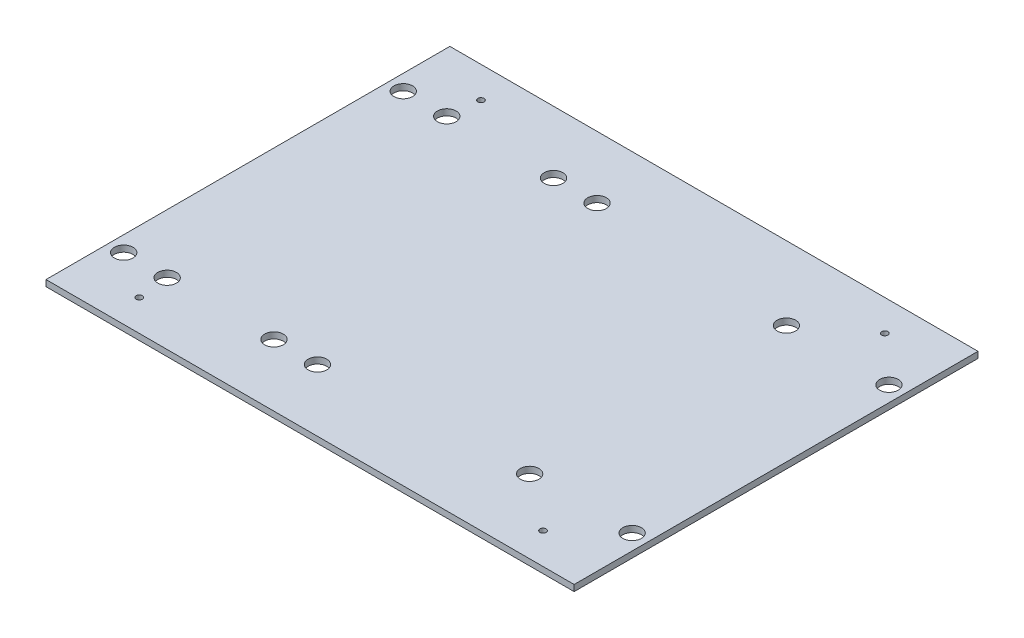
ISO-10303-21;
HEADER;
FILE_DESCRIPTION(('STEP AP214'),'2;1');
FILE_NAME('part.step','',(''),(''),'','','');
FILE_SCHEMA(('AUTOMOTIVE_DESIGN { 1 0 10303 214 1 1 1 1 }'));
ENDSEC;
DATA;
#1=APPLICATION_CONTEXT('core data for automotive mechanical design processes');
#2=APPLICATION_PROTOCOL_DEFINITION('international standard','automotive_design',2000,#1);
#3=PRODUCT_CONTEXT('',#1,'mechanical');
#4=PRODUCT('Part','Part','',(#3));
#5=PRODUCT_RELATED_PRODUCT_CATEGORY('part','',(#4));
#6=PRODUCT_DEFINITION_FORMATION('','',#4);
#7=PRODUCT_DEFINITION_CONTEXT('part definition',#1,'design');
#8=PRODUCT_DEFINITION('design','',#6,#7);
#9=PRODUCT_DEFINITION_SHAPE('','',#8);
#10=(LENGTH_UNIT() NAMED_UNIT(*) SI_UNIT(.MILLI.,.METRE.));
#11=(NAMED_UNIT(*) PLANE_ANGLE_UNIT() SI_UNIT($,.RADIAN.));
#12=(NAMED_UNIT(*) SI_UNIT($,.STERADIAN.) SOLID_ANGLE_UNIT());
#13=UNCERTAINTY_MEASURE_WITH_UNIT(LENGTH_MEASURE(1.E-05),#10,'distance_accuracy_value','');
#14=(GEOMETRIC_REPRESENTATION_CONTEXT(3) GLOBAL_UNCERTAINTY_ASSIGNED_CONTEXT((#13)) GLOBAL_UNIT_ASSIGNED_CONTEXT((#10,
#11,#12)) REPRESENTATION_CONTEXT('',''));
#15=CARTESIAN_POINT('',(0.,0.,0.));
#16=DIRECTION('',(0.,0.,1.));
#17=DIRECTION('',(1.,0.,0.));
#18=AXIS2_PLACEMENT_3D('',#15,#16,#17);
#19=CARTESIAN_POINT('',(0.,2.,0.));
#20=DIRECTION('',(0.,1.,0.));
#21=DIRECTION('',(0.,0.,1.));
#22=AXIS2_PLACEMENT_3D('',#19,#20,#21);
#23=PLANE('',#22);
#24=CARTESIAN_POINT('',(65.0000000000001,2.,55.));
#25=DIRECTION('',(0.,1.,0.));
#26=DIRECTION('',(0.,0.,1.));
#27=AXIS2_PLACEMENT_3D('',#24,#25,#26);
#28=CIRCLE('',#27,0.999999999999998);
#29=CARTESIAN_POINT('',(65.0000000000001,2.,56.));
#30=VERTEX_POINT('',#29);
#31=EDGE_CURVE('E131',#30,#30,#28,.T.);
#32=ORIENTED_EDGE('',*,*,#31,.F.);
#33=EDGE_LOOP('',(#32));
#34=FACE_BOUND('',#33,.T.);
#35=CARTESIAN_POINT('',(65.0000000000001,2.,-55.));
#36=DIRECTION('',(0.,1.,0.));
#37=DIRECTION('',(0.,0.,1.));
#38=AXIS2_PLACEMENT_3D('',#35,#36,#37);
#39=CIRCLE('',#38,0.999999999999998);
#40=CARTESIAN_POINT('',(65.0000000000001,2.,-54.));
#41=VERTEX_POINT('',#40);
#42=EDGE_CURVE('E121',#41,#41,#39,.T.);
#43=ORIENTED_EDGE('',*,*,#42,.F.);
#44=EDGE_LOOP('',(#43));
#45=FACE_BOUND('',#44,.T.);
#46=CARTESIAN_POINT('',(-65.,2.,-55.));
#47=DIRECTION('',(0.,1.,0.));
#48=DIRECTION('',(0.,0.,1.));
#49=AXIS2_PLACEMENT_3D('',#46,#47,#48);
#50=CIRCLE('',#49,0.999999999999998);
#51=CARTESIAN_POINT('',(-65.,2.,-54.));
#52=VERTEX_POINT('',#51);
#53=EDGE_CURVE('E118',#52,#52,#50,.T.);
#54=ORIENTED_EDGE('',*,*,#53,.F.);
#55=EDGE_LOOP('',(#54));
#56=FACE_BOUND('',#55,.T.);
#57=CARTESIAN_POINT('',(-65.,2.,55.));
#58=DIRECTION('',(0.,1.,0.));
#59=DIRECTION('',(0.,0.,1.));
#60=AXIS2_PLACEMENT_3D('',#57,#58,#59);
#61=CIRCLE('',#60,0.999999999999998);
#62=CARTESIAN_POINT('',(-65.,2.,56.));
#63=VERTEX_POINT('',#62);
#64=EDGE_CURVE('E115',#63,#63,#61,.T.);
#65=ORIENTED_EDGE('',*,*,#64,.F.);
#66=EDGE_LOOP('',(#65));
#67=FACE_BOUND('',#66,.T.);
#68=CARTESIAN_POINT('',(80.0000000000001,2.,41.33));
#69=DIRECTION('',(0.,1.,0.));
#70=DIRECTION('',(0.,0.,-1.));
#71=AXIS2_PLACEMENT_3D('',#68,#69,#70);
#72=CIRCLE('',#71,3.00000000000002);
#73=CARTESIAN_POINT('',(80.0000000000001,2.,38.33));
#74=VERTEX_POINT('',#73);
#75=EDGE_CURVE('E142',#74,#74,#72,.T.);
#76=ORIENTED_EDGE('',*,*,#75,.F.);
#77=EDGE_LOOP('',(#76));
#78=FACE_BOUND('',#77,.T.);
#79=CARTESIAN_POINT('',(80.0000000000001,2.,-41.33));
#80=DIRECTION('',(0.,1.,0.));
#81=DIRECTION('',(0.,0.,1.));
#82=AXIS2_PLACEMENT_3D('',#79,#80,#81);
#83=CIRCLE('',#82,3.00000000000001);
#84=CARTESIAN_POINT('',(80.0000000000001,2.,-38.33));
#85=VERTEX_POINT('',#84);
#86=EDGE_CURVE('E154',#85,#85,#83,.T.);
#87=ORIENTED_EDGE('',*,*,#86,.F.);
#88=EDGE_LOOP('',(#87));
#89=FACE_BOUND('',#88,.T.);
#90=CARTESIAN_POINT('',(-17.6214312802723,2.,-45.));
#91=DIRECTION('',(0.,1.,0.));
#92=DIRECTION('',(0.,0.,-1.));
#93=AXIS2_PLACEMENT_3D('',#90,#91,#92);
#94=CIRCLE('',#93,3.00000000000001);
#95=CARTESIAN_POINT('',(-17.6214312802723,2.,-48.));
#96=VERTEX_POINT('',#95);
#97=EDGE_CURVE('E166',#96,#96,#94,.T.);
#98=ORIENTED_EDGE('',*,*,#97,.F.);
#99=EDGE_LOOP('',(#98));
#100=FACE_BOUND('',#99,.T.);
#101=CARTESIAN_POINT('',(-31.6214312802723,2.,45.));
#102=DIRECTION('',(0.,1.,0.));
#103=DIRECTION('',(0.,0.,-1.));
#104=AXIS2_PLACEMENT_3D('',#101,#102,#103);
#105=CIRCLE('',#104,3.00000000000001);
#106=CARTESIAN_POINT('',(-31.6214312802723,2.,42.));
#107=VERTEX_POINT('',#106);
#108=EDGE_CURVE('E178',#107,#107,#105,.T.);
#109=ORIENTED_EDGE('',*,*,#108,.F.);
#110=EDGE_LOOP('',(#109));
#111=FACE_BOUND('',#110,.T.);
#112=CARTESIAN_POINT('',(-66.,2.,45.));
#113=DIRECTION('',(0.,1.,0.));
#114=DIRECTION('',(0.,0.,1.));
#115=AXIS2_PLACEMENT_3D('',#112,#113,#114);
#116=CIRCLE('',#115,3.00000000000001);
#117=CARTESIAN_POINT('',(-66.,2.,48.));
#118=VERTEX_POINT('',#117);
#119=EDGE_CURVE('E190',#118,#118,#116,.T.);
#120=ORIENTED_EDGE('',*,*,#119,.F.);
#121=EDGE_LOOP('',(#120));
#122=FACE_BOUND('',#121,.T.);
#123=CARTESIAN_POINT('',(-80.,2.,-45.));
#124=DIRECTION('',(0.,1.,0.));
#125=DIRECTION('',(0.,0.,1.));
#126=AXIS2_PLACEMENT_3D('',#123,#124,#125);
#127=CIRCLE('',#126,3.00000000000001);
#128=CARTESIAN_POINT('',(-80.,2.,-42.));
#129=VERTEX_POINT('',#128);
#130=EDGE_CURVE('E105',#129,#129,#127,.T.);
#131=ORIENTED_EDGE('',*,*,#130,.F.);
#132=EDGE_LOOP('',(#131));
#133=FACE_BOUND('',#132,.T.);
#134=DIRECTION('',(0.,0.,1.));
#135=VECTOR('',#134,1.);
#136=CARTESIAN_POINT('',(-85.,2.,-65.));
#137=LINE('',#136,#135);
#138=CARTESIAN_POINT('',(-85.,2.,-65.));
#139=VERTEX_POINT('',#138);
#140=CARTESIAN_POINT('',(-85.,2.,65.));
#141=VERTEX_POINT('',#140);
#142=EDGE_CURVE('E89',#139,#141,#137,.T.);
#143=ORIENTED_EDGE('',*,*,#142,.T.);
#144=DIRECTION('',(1.,0.,0.));
#145=VECTOR('',#144,1.);
#146=CARTESIAN_POINT('',(-85.,2.,65.));
#147=LINE('',#146,#145);
#148=CARTESIAN_POINT('',(85.0000000000001,2.,65.));
#149=VERTEX_POINT('',#148);
#150=EDGE_CURVE('E84',#141,#149,#147,.T.);
#151=ORIENTED_EDGE('',*,*,#150,.T.);
#152=DIRECTION('',(0.,0.,-1.));
#153=VECTOR('',#152,1.);
#154=CARTESIAN_POINT('',(85.0000000000001,2.,-65.));
#155=LINE('',#154,#153);
#156=CARTESIAN_POINT('',(85.0000000000001,2.,-65.));
#157=VERTEX_POINT('',#156);
#158=EDGE_CURVE('E87',#149,#157,#155,.T.);
#159=ORIENTED_EDGE('',*,*,#158,.T.);
#160=DIRECTION('',(-1.,0.,0.));
#161=VECTOR('',#160,1.);
#162=CARTESIAN_POINT('',(-85.,2.,-65.));
#163=LINE('',#162,#161);
#164=EDGE_CURVE('E54',#157,#139,#163,.T.);
#165=ORIENTED_EDGE('',*,*,#164,.T.);
#166=EDGE_LOOP('',(#143,#151,#159,#165));
#167=FACE_BOUND('',#166,.T.);
#168=CARTESIAN_POINT('',(-66.,2.,-45.));
#169=DIRECTION('',(0.,1.,0.));
#170=DIRECTION('',(0.,0.,1.));
#171=AXIS2_PLACEMENT_3D('',#168,#169,#170);
#172=CIRCLE('',#171,3.00000000000001);
#173=CARTESIAN_POINT('',(-66.,2.,-42.));
#174=VERTEX_POINT('',#173);
#175=EDGE_CURVE('E196',#174,#174,#172,.T.);
#176=ORIENTED_EDGE('',*,*,#175,.F.);
#177=EDGE_LOOP('',(#176));
#178=FACE_BOUND('',#177,.T.);
#179=CARTESIAN_POINT('',(-80.,2.,45.));
#180=DIRECTION('',(0.,1.,0.));
#181=DIRECTION('',(0.,0.,1.));
#182=AXIS2_PLACEMENT_3D('',#179,#180,#181);
#183=CIRCLE('',#182,3.00000000000001);
#184=CARTESIAN_POINT('',(-80.,2.,48.));
#185=VERTEX_POINT('',#184);
#186=EDGE_CURVE('E184',#185,#185,#183,.T.);
#187=ORIENTED_EDGE('',*,*,#186,.F.);
#188=EDGE_LOOP('',(#187));
#189=FACE_BOUND('',#188,.T.);
#190=CARTESIAN_POINT('',(-17.6214312802723,2.,45.));
#191=DIRECTION('',(0.,1.,0.));
#192=DIRECTION('',(0.,0.,-1.));
#193=AXIS2_PLACEMENT_3D('',#190,#191,#192);
#194=CIRCLE('',#193,3.00000000000001);
#195=CARTESIAN_POINT('',(-17.6214312802723,2.,42.));
#196=VERTEX_POINT('',#195);
#197=EDGE_CURVE('E172',#196,#196,#194,.T.);
#198=ORIENTED_EDGE('',*,*,#197,.F.);
#199=EDGE_LOOP('',(#198));
#200=FACE_BOUND('',#199,.T.);
#201=CARTESIAN_POINT('',(-31.6214312802723,2.,-45.));
#202=DIRECTION('',(0.,1.,0.));
#203=DIRECTION('',(0.,0.,-1.));
#204=AXIS2_PLACEMENT_3D('',#201,#202,#203);
#205=CIRCLE('',#204,3.00000000000001);
#206=CARTESIAN_POINT('',(-31.6214312802723,2.,-48.));
#207=VERTEX_POINT('',#206);
#208=EDGE_CURVE('E160',#207,#207,#205,.T.);
#209=ORIENTED_EDGE('',*,*,#208,.F.);
#210=EDGE_LOOP('',(#209));
#211=FACE_BOUND('',#210,.T.);
#212=CARTESIAN_POINT('',(47.0000000000001,2.,-41.33));
#213=DIRECTION('',(0.,1.,0.));
#214=DIRECTION('',(0.,0.,1.));
#215=AXIS2_PLACEMENT_3D('',#212,#213,#214);
#216=CIRCLE('',#215,3.00000000000001);
#217=CARTESIAN_POINT('',(47.0000000000001,2.,-38.33));
#218=VERTEX_POINT('',#217);
#219=EDGE_CURVE('E148',#218,#218,#216,.T.);
#220=ORIENTED_EDGE('',*,*,#219,.F.);
#221=EDGE_LOOP('',(#220));
#222=FACE_BOUND('',#221,.T.);
#223=CARTESIAN_POINT('',(47.0000000000001,2.,41.33));
#224=DIRECTION('',(0.,1.,0.));
#225=DIRECTION('',(0.,0.,-1.));
#226=AXIS2_PLACEMENT_3D('',#223,#224,#225);
#227=CIRCLE('',#226,3.00000000000001);
#228=CARTESIAN_POINT('',(47.0000000000001,2.,38.33));
#229=VERTEX_POINT('',#228);
#230=EDGE_CURVE('E136',#229,#229,#227,.T.);
#231=ORIENTED_EDGE('',*,*,#230,.F.);
#232=EDGE_LOOP('',(#231));
#233=FACE_BOUND('',#232,.T.);
#234=ADVANCED_FACE('F35',(#34,#45,#56,#67,#78,#89,#100,#111,#122,#133,#167,#178,#189,#200,#211,
#222,#233),#23,.T.);
#235=CARTESIAN_POINT('',(0.,0.,0.));
#236=DIRECTION('',(0.,1.,0.));
#237=DIRECTION('',(0.,0.,1.));
#238=AXIS2_PLACEMENT_3D('',#235,#236,#237);
#239=PLANE('',#238);
#240=CARTESIAN_POINT('',(65.0000000000001,0.,55.));
#241=DIRECTION('',(0.,1.,0.));
#242=DIRECTION('',(0.,0.,1.));
#243=AXIS2_PLACEMENT_3D('',#240,#241,#242);
#244=CIRCLE('',#243,0.999999999999998);
#245=CARTESIAN_POINT('',(65.0000000000001,0.,56.));
#246=VERTEX_POINT('',#245);
#247=EDGE_CURVE('E39',#246,#246,#244,.T.);
#248=ORIENTED_EDGE('',*,*,#247,.T.);
#249=EDGE_LOOP('',(#248));
#250=FACE_BOUND('',#249,.T.);
#251=CARTESIAN_POINT('',(65.0000000000001,0.,-55.));
#252=DIRECTION('',(0.,1.,0.));
#253=DIRECTION('',(0.,0.,1.));
#254=AXIS2_PLACEMENT_3D('',#251,#252,#253);
#255=CIRCLE('',#254,0.999999999999998);
#256=CARTESIAN_POINT('',(65.0000000000001,0.,-54.));
#257=VERTEX_POINT('',#256);
#258=EDGE_CURVE('E119',#257,#257,#255,.T.);
#259=ORIENTED_EDGE('',*,*,#258,.T.);
#260=EDGE_LOOP('',(#259));
#261=FACE_BOUND('',#260,.T.);
#262=CARTESIAN_POINT('',(-65.,0.,-55.));
#263=DIRECTION('',(0.,1.,0.));
#264=DIRECTION('',(0.,0.,1.));
#265=AXIS2_PLACEMENT_3D('',#262,#263,#264);
#266=CIRCLE('',#265,0.999999999999998);
#267=CARTESIAN_POINT('',(-65.,0.,-54.));
#268=VERTEX_POINT('',#267);
#269=EDGE_CURVE('E116',#268,#268,#266,.T.);
#270=ORIENTED_EDGE('',*,*,#269,.T.);
#271=EDGE_LOOP('',(#270));
#272=FACE_BOUND('',#271,.T.);
#273=CARTESIAN_POINT('',(-65.,0.,55.));
#274=DIRECTION('',(0.,1.,0.));
#275=DIRECTION('',(0.,0.,1.));
#276=AXIS2_PLACEMENT_3D('',#273,#274,#275);
#277=CIRCLE('',#276,0.999999999999998);
#278=CARTESIAN_POINT('',(-65.,0.,56.));
#279=VERTEX_POINT('',#278);
#280=EDGE_CURVE('E111',#279,#279,#277,.T.);
#281=ORIENTED_EDGE('',*,*,#280,.T.);
#282=EDGE_LOOP('',(#281));
#283=FACE_BOUND('',#282,.T.);
#284=CARTESIAN_POINT('',(80.0000000000001,0.,41.33));
#285=DIRECTION('',(0.,1.,0.));
#286=DIRECTION('',(0.,0.,-1.));
#287=AXIS2_PLACEMENT_3D('',#284,#285,#286);
#288=CIRCLE('',#287,3.00000000000002);
#289=CARTESIAN_POINT('',(80.0000000000001,0.,38.33));
#290=VERTEX_POINT('',#289);
#291=EDGE_CURVE('E139',#290,#290,#288,.T.);
#292=ORIENTED_EDGE('',*,*,#291,.T.);
#293=EDGE_LOOP('',(#292));
#294=FACE_BOUND('',#293,.T.);
#295=CARTESIAN_POINT('',(80.0000000000001,0.,-41.33));
#296=DIRECTION('',(0.,1.,0.));
#297=DIRECTION('',(0.,0.,1.));
#298=AXIS2_PLACEMENT_3D('',#295,#296,#297);
#299=CIRCLE('',#298,3.00000000000001);
#300=CARTESIAN_POINT('',(80.0000000000001,0.,-38.33));
#301=VERTEX_POINT('',#300);
#302=EDGE_CURVE('E151',#301,#301,#299,.T.);
#303=ORIENTED_EDGE('',*,*,#302,.T.);
#304=EDGE_LOOP('',(#303));
#305=FACE_BOUND('',#304,.T.);
#306=CARTESIAN_POINT('',(-17.6214312802723,0.,-45.));
#307=DIRECTION('',(0.,1.,0.));
#308=DIRECTION('',(0.,0.,-1.));
#309=AXIS2_PLACEMENT_3D('',#306,#307,#308);
#310=CIRCLE('',#309,3.00000000000001);
#311=CARTESIAN_POINT('',(-17.6214312802723,0.,-48.));
#312=VERTEX_POINT('',#311);
#313=EDGE_CURVE('E163',#312,#312,#310,.T.);
#314=ORIENTED_EDGE('',*,*,#313,.T.);
#315=EDGE_LOOP('',(#314));
#316=FACE_BOUND('',#315,.T.);
#317=CARTESIAN_POINT('',(-31.6214312802723,0.,45.));
#318=DIRECTION('',(0.,1.,0.));
#319=DIRECTION('',(0.,0.,-1.));
#320=AXIS2_PLACEMENT_3D('',#317,#318,#319);
#321=CIRCLE('',#320,3.00000000000001);
#322=CARTESIAN_POINT('',(-31.6214312802723,0.,42.));
#323=VERTEX_POINT('',#322);
#324=EDGE_CURVE('E175',#323,#323,#321,.T.);
#325=ORIENTED_EDGE('',*,*,#324,.T.);
#326=EDGE_LOOP('',(#325));
#327=FACE_BOUND('',#326,.T.);
#328=CARTESIAN_POINT('',(-66.,0.,45.));
#329=DIRECTION('',(0.,1.,0.));
#330=DIRECTION('',(0.,0.,1.));
#331=AXIS2_PLACEMENT_3D('',#328,#329,#330);
#332=CIRCLE('',#331,3.00000000000001);
#333=CARTESIAN_POINT('',(-66.,0.,48.));
#334=VERTEX_POINT('',#333);
#335=EDGE_CURVE('E187',#334,#334,#332,.T.);
#336=ORIENTED_EDGE('',*,*,#335,.T.);
#337=EDGE_LOOP('',(#336));
#338=FACE_BOUND('',#337,.T.);
#339=CARTESIAN_POINT('',(-80.,0.,-45.));
#340=DIRECTION('',(0.,1.,0.));
#341=DIRECTION('',(0.,0.,1.));
#342=AXIS2_PLACEMENT_3D('',#339,#340,#341);
#343=CIRCLE('',#342,3.00000000000001);
#344=CARTESIAN_POINT('',(-80.,0.,-42.));
#345=VERTEX_POINT('',#344);
#346=EDGE_CURVE('E199',#345,#345,#343,.T.);
#347=ORIENTED_EDGE('',*,*,#346,.T.);
#348=EDGE_LOOP('',(#347));
#349=FACE_BOUND('',#348,.T.);
#350=DIRECTION('',(0.,0.,1.));
#351=VECTOR('',#350,1.);
#352=CARTESIAN_POINT('',(-85.,0.,-65.));
#353=LINE('',#352,#351);
#354=CARTESIAN_POINT('',(-85.,0.,-65.));
#355=VERTEX_POINT('',#354);
#356=CARTESIAN_POINT('',(-85.,0.,65.));
#357=VERTEX_POINT('',#356);
#358=EDGE_CURVE('E102',#355,#357,#353,.T.);
#359=ORIENTED_EDGE('',*,*,#358,.F.);
#360=DIRECTION('',(-1.,0.,0.));
#361=VECTOR('',#360,1.);
#362=CARTESIAN_POINT('',(-85.,0.,-65.));
#363=LINE('',#362,#361);
#364=CARTESIAN_POINT('',(85.0000000000001,0.,-65.));
#365=VERTEX_POINT('',#364);
#366=EDGE_CURVE('E77',#365,#355,#363,.T.);
#367=ORIENTED_EDGE('',*,*,#366,.F.);
#368=DIRECTION('',(0.,0.,-1.));
#369=VECTOR('',#368,1.);
#370=CARTESIAN_POINT('',(85.0000000000001,0.,-65.));
#371=LINE('',#370,#369);
#372=CARTESIAN_POINT('',(85.0000000000001,0.,65.));
#373=VERTEX_POINT('',#372);
#374=EDGE_CURVE('E71',#373,#365,#371,.T.);
#375=ORIENTED_EDGE('',*,*,#374,.F.);
#376=DIRECTION('',(1.,0.,0.));
#377=VECTOR('',#376,1.);
#378=CARTESIAN_POINT('',(-85.,0.,65.));
#379=LINE('',#378,#377);
#380=EDGE_CURVE('E93',#357,#373,#379,.T.);
#381=ORIENTED_EDGE('',*,*,#380,.F.);
#382=EDGE_LOOP('',(#359,#367,#375,#381));
#383=FACE_BOUND('',#382,.T.);
#384=CARTESIAN_POINT('',(-66.,0.,-45.));
#385=DIRECTION('',(0.,1.,0.));
#386=DIRECTION('',(0.,0.,1.));
#387=AXIS2_PLACEMENT_3D('',#384,#385,#386);
#388=CIRCLE('',#387,3.00000000000001);
#389=CARTESIAN_POINT('',(-66.,0.,-42.));
#390=VERTEX_POINT('',#389);
#391=EDGE_CURVE('E193',#390,#390,#388,.T.);
#392=ORIENTED_EDGE('',*,*,#391,.T.);
#393=EDGE_LOOP('',(#392));
#394=FACE_BOUND('',#393,.T.);
#395=CARTESIAN_POINT('',(-80.,0.,45.));
#396=DIRECTION('',(0.,1.,0.));
#397=DIRECTION('',(0.,0.,1.));
#398=AXIS2_PLACEMENT_3D('',#395,#396,#397);
#399=CIRCLE('',#398,3.00000000000001);
#400=CARTESIAN_POINT('',(-80.,0.,48.));
#401=VERTEX_POINT('',#400);
#402=EDGE_CURVE('E181',#401,#401,#399,.T.);
#403=ORIENTED_EDGE('',*,*,#402,.T.);
#404=EDGE_LOOP('',(#403));
#405=FACE_BOUND('',#404,.T.);
#406=CARTESIAN_POINT('',(-17.6214312802723,0.,45.));
#407=DIRECTION('',(0.,1.,0.));
#408=DIRECTION('',(0.,0.,-1.));
#409=AXIS2_PLACEMENT_3D('',#406,#407,#408);
#410=CIRCLE('',#409,3.00000000000001);
#411=CARTESIAN_POINT('',(-17.6214312802723,0.,42.));
#412=VERTEX_POINT('',#411);
#413=EDGE_CURVE('E169',#412,#412,#410,.T.);
#414=ORIENTED_EDGE('',*,*,#413,.T.);
#415=EDGE_LOOP('',(#414));
#416=FACE_BOUND('',#415,.T.);
#417=CARTESIAN_POINT('',(-31.6214312802723,0.,-45.));
#418=DIRECTION('',(0.,1.,0.));
#419=DIRECTION('',(0.,0.,-1.));
#420=AXIS2_PLACEMENT_3D('',#417,#418,#419);
#421=CIRCLE('',#420,3.00000000000001);
#422=CARTESIAN_POINT('',(-31.6214312802723,0.,-48.));
#423=VERTEX_POINT('',#422);
#424=EDGE_CURVE('E157',#423,#423,#421,.T.);
#425=ORIENTED_EDGE('',*,*,#424,.T.);
#426=EDGE_LOOP('',(#425));
#427=FACE_BOUND('',#426,.T.);
#428=CARTESIAN_POINT('',(47.0000000000001,0.,-41.33));
#429=DIRECTION('',(0.,1.,0.));
#430=DIRECTION('',(0.,0.,1.));
#431=AXIS2_PLACEMENT_3D('',#428,#429,#430);
#432=CIRCLE('',#431,3.00000000000001);
#433=CARTESIAN_POINT('',(47.0000000000001,0.,-38.33));
#434=VERTEX_POINT('',#433);
#435=EDGE_CURVE('E145',#434,#434,#432,.T.);
#436=ORIENTED_EDGE('',*,*,#435,.T.);
#437=EDGE_LOOP('',(#436));
#438=FACE_BOUND('',#437,.T.);
#439=CARTESIAN_POINT('',(47.0000000000001,0.,41.33));
#440=DIRECTION('',(0.,1.,0.));
#441=DIRECTION('',(0.,0.,-1.));
#442=AXIS2_PLACEMENT_3D('',#439,#440,#441);
#443=CIRCLE('',#442,3.00000000000001);
#444=CARTESIAN_POINT('',(47.0000000000001,0.,38.33));
#445=VERTEX_POINT('',#444);
#446=EDGE_CURVE('E114',#445,#445,#443,.T.);
#447=ORIENTED_EDGE('',*,*,#446,.T.);
#448=EDGE_LOOP('',(#447));
#449=FACE_BOUND('',#448,.T.);
#450=ADVANCED_FACE('F207',(#250,#261,#272,#283,#294,#305,#316,#327,#338,#349,#383,#394,#405,
#416,#427,#438,#449),#239,.F.);
#451=CARTESIAN_POINT('',(-85.,2.,-65.));
#452=DIRECTION('',(1.,0.,0.));
#453=DIRECTION('',(0.,0.,-1.));
#454=AXIS2_PLACEMENT_3D('',#451,#452,#453);
#455=PLANE('',#454);
#456=ORIENTED_EDGE('',*,*,#358,.T.);
#457=DIRECTION('',(0.,-1.,0.));
#458=VECTOR('',#457,1.);
#459=CARTESIAN_POINT('',(-85.,2.,65.));
#460=LINE('',#459,#458);
#461=EDGE_CURVE('E11',#141,#357,#460,.T.);
#462=ORIENTED_EDGE('',*,*,#461,.F.);
#463=ORIENTED_EDGE('',*,*,#142,.F.);
#464=DIRECTION('',(0.,-1.,0.));
#465=VECTOR('',#464,1.);
#466=CARTESIAN_POINT('',(-85.,2.,-65.));
#467=LINE('',#466,#465);
#468=EDGE_CURVE('E98',#139,#355,#467,.T.);
#469=ORIENTED_EDGE('',*,*,#468,.T.);
#470=EDGE_LOOP('',(#456,#462,#463,#469));
#471=FACE_BOUND('',#470,.T.);
#472=ADVANCED_FACE('F37',(#471),#455,.F.);
#473=CARTESIAN_POINT('',(-85.,2.,65.));
#474=DIRECTION('',(0.,0.,-1.));
#475=DIRECTION('',(-1.,0.,0.));
#476=AXIS2_PLACEMENT_3D('',#473,#474,#475);
#477=PLANE('',#476);
#478=ORIENTED_EDGE('',*,*,#380,.T.);
#479=DIRECTION('',(0.,-1.,0.));
#480=VECTOR('',#479,1.);
#481=CARTESIAN_POINT('',(85.0000000000001,2.,65.));
#482=LINE('',#481,#480);
#483=EDGE_CURVE('E45',#149,#373,#482,.T.);
#484=ORIENTED_EDGE('',*,*,#483,.F.);
#485=ORIENTED_EDGE('',*,*,#150,.F.);
#486=ORIENTED_EDGE('',*,*,#461,.T.);
#487=EDGE_LOOP('',(#478,#484,#485,#486));
#488=FACE_BOUND('',#487,.T.);
#489=ADVANCED_FACE('F92',(#488),#477,.F.);
#490=CARTESIAN_POINT('',(85.0000000000001,2.,-65.));
#491=DIRECTION('',(-1.,0.,0.));
#492=DIRECTION('',(0.,0.,1.));
#493=AXIS2_PLACEMENT_3D('',#490,#491,#492);
#494=PLANE('',#493);
#495=ORIENTED_EDGE('',*,*,#374,.T.);
#496=DIRECTION('',(0.,-1.,0.));
#497=VECTOR('',#496,1.);
#498=CARTESIAN_POINT('',(85.0000000000001,2.,-65.));
#499=LINE('',#498,#497);
#500=EDGE_CURVE('E94',#157,#365,#499,.T.);
#501=ORIENTED_EDGE('',*,*,#500,.F.);
#502=ORIENTED_EDGE('',*,*,#158,.F.);
#503=ORIENTED_EDGE('',*,*,#483,.T.);
#504=EDGE_LOOP('',(#495,#501,#502,#503));
#505=FACE_BOUND('',#504,.T.);
#506=ADVANCED_FACE('F96',(#505),#494,.F.);
#507=CARTESIAN_POINT('',(-85.,2.,-65.));
#508=DIRECTION('',(0.,0.,1.));
#509=DIRECTION('',(1.,0.,0.));
#510=AXIS2_PLACEMENT_3D('',#507,#508,#509);
#511=PLANE('',#510);
#512=ORIENTED_EDGE('',*,*,#366,.T.);
#513=ORIENTED_EDGE('',*,*,#468,.F.);
#514=ORIENTED_EDGE('',*,*,#164,.F.);
#515=ORIENTED_EDGE('',*,*,#500,.T.);
#516=EDGE_LOOP('',(#512,#513,#514,#515));
#517=FACE_BOUND('',#516,.T.);
#518=ADVANCED_FACE('F213',(#517),#511,.F.);
#519=CARTESIAN_POINT('',(-80.,2.,-45.));
#520=DIRECTION('',(0.,-1.,0.));
#521=DIRECTION('',(0.,0.,-1.));
#522=AXIS2_PLACEMENT_3D('',#519,#520,#521);
#523=CYLINDRICAL_SURFACE('',#522,3.00000000000001);
#524=ORIENTED_EDGE('',*,*,#130,.T.);
#525=EDGE_LOOP('',(#524));
#526=FACE_BOUND('',#525,.T.);
#527=ORIENTED_EDGE('',*,*,#346,.F.);
#528=EDGE_LOOP('',(#527));
#529=FACE_BOUND('',#528,.T.);
#530=ADVANCED_FACE('F210',(#526,#529),#523,.F.);
#531=CARTESIAN_POINT('',(-66.,2.,-45.));
#532=DIRECTION('',(0.,-1.,0.));
#533=DIRECTION('',(0.,0.,-1.));
#534=AXIS2_PLACEMENT_3D('',#531,#532,#533);
#535=CYLINDRICAL_SURFACE('',#534,3.00000000000001);
#536=ORIENTED_EDGE('',*,*,#175,.T.);
#537=EDGE_LOOP('',(#536));
#538=FACE_BOUND('',#537,.T.);
#539=ORIENTED_EDGE('',*,*,#391,.F.);
#540=EDGE_LOOP('',(#539));
#541=FACE_BOUND('',#540,.T.);
#542=ADVANCED_FACE('F212',(#538,#541),#535,.F.);
#543=CARTESIAN_POINT('',(-66.,2.,45.));
#544=DIRECTION('',(0.,-1.,0.));
#545=DIRECTION('',(0.,0.,-1.));
#546=AXIS2_PLACEMENT_3D('',#543,#544,#545);
#547=CYLINDRICAL_SURFACE('',#546,3.00000000000001);
#548=ORIENTED_EDGE('',*,*,#119,.T.);
#549=EDGE_LOOP('',(#548));
#550=FACE_BOUND('',#549,.T.);
#551=ORIENTED_EDGE('',*,*,#335,.F.);
#552=EDGE_LOOP('',(#551));
#553=FACE_BOUND('',#552,.T.);
#554=ADVANCED_FACE('F220',(#550,#553),#547,.F.);
#555=CARTESIAN_POINT('',(-80.,2.,45.));
#556=DIRECTION('',(0.,-1.,0.));
#557=DIRECTION('',(0.,0.,-1.));
#558=AXIS2_PLACEMENT_3D('',#555,#556,#557);
#559=CYLINDRICAL_SURFACE('',#558,3.00000000000001);
#560=ORIENTED_EDGE('',*,*,#186,.T.);
#561=EDGE_LOOP('',(#560));
#562=FACE_BOUND('',#561,.T.);
#563=ORIENTED_EDGE('',*,*,#402,.F.);
#564=EDGE_LOOP('',(#563));
#565=FACE_BOUND('',#564,.T.);
#566=ADVANCED_FACE('F297',(#562,#565),#559,.F.);
#567=CARTESIAN_POINT('',(-31.6214312802723,2.,45.));
#568=DIRECTION('',(0.,-1.,0.));
#569=DIRECTION('',(0.,0.,-1.));
#570=AXIS2_PLACEMENT_3D('',#567,#568,#569);
#571=CYLINDRICAL_SURFACE('',#570,3.00000000000001);
#572=ORIENTED_EDGE('',*,*,#108,.T.);
#573=EDGE_LOOP('',(#572));
#574=FACE_BOUND('',#573,.T.);
#575=ORIENTED_EDGE('',*,*,#324,.F.);
#576=EDGE_LOOP('',(#575));
#577=FACE_BOUND('',#576,.T.);
#578=ADVANCED_FACE('F293',(#574,#577),#571,.F.);
#579=CARTESIAN_POINT('',(-17.6214312802723,2.,45.));
#580=DIRECTION('',(0.,-1.,0.));
#581=DIRECTION('',(0.,0.,-1.));
#582=AXIS2_PLACEMENT_3D('',#579,#580,#581);
#583=CYLINDRICAL_SURFACE('',#582,3.00000000000001);
#584=ORIENTED_EDGE('',*,*,#197,.T.);
#585=EDGE_LOOP('',(#584));
#586=FACE_BOUND('',#585,.T.);
#587=ORIENTED_EDGE('',*,*,#413,.F.);
#588=EDGE_LOOP('',(#587));
#589=FACE_BOUND('',#588,.T.);
#590=ADVANCED_FACE('F289',(#586,#589),#583,.F.);
#591=CARTESIAN_POINT('',(-17.6214312802723,2.,-45.));
#592=DIRECTION('',(0.,-1.,0.));
#593=DIRECTION('',(0.,0.,-1.));
#594=AXIS2_PLACEMENT_3D('',#591,#592,#593);
#595=CYLINDRICAL_SURFACE('',#594,3.00000000000001);
#596=ORIENTED_EDGE('',*,*,#97,.T.);
#597=EDGE_LOOP('',(#596));
#598=FACE_BOUND('',#597,.T.);
#599=ORIENTED_EDGE('',*,*,#313,.F.);
#600=EDGE_LOOP('',(#599));
#601=FACE_BOUND('',#600,.T.);
#602=ADVANCED_FACE('F285',(#598,#601),#595,.F.);
#603=CARTESIAN_POINT('',(-31.6214312802723,2.,-45.));
#604=DIRECTION('',(0.,-1.,0.));
#605=DIRECTION('',(0.,0.,-1.));
#606=AXIS2_PLACEMENT_3D('',#603,#604,#605);
#607=CYLINDRICAL_SURFACE('',#606,3.00000000000001);
#608=ORIENTED_EDGE('',*,*,#208,.T.);
#609=EDGE_LOOP('',(#608));
#610=FACE_BOUND('',#609,.T.);
#611=ORIENTED_EDGE('',*,*,#424,.F.);
#612=EDGE_LOOP('',(#611));
#613=FACE_BOUND('',#612,.T.);
#614=ADVANCED_FACE('F281',(#610,#613),#607,.F.);
#615=CARTESIAN_POINT('',(80.0000000000001,2.,-41.33));
#616=DIRECTION('',(0.,-1.,0.));
#617=DIRECTION('',(0.,0.,-1.));
#618=AXIS2_PLACEMENT_3D('',#615,#616,#617);
#619=CYLINDRICAL_SURFACE('',#618,3.00000000000001);
#620=ORIENTED_EDGE('',*,*,#86,.T.);
#621=EDGE_LOOP('',(#620));
#622=FACE_BOUND('',#621,.T.);
#623=ORIENTED_EDGE('',*,*,#302,.F.);
#624=EDGE_LOOP('',(#623));
#625=FACE_BOUND('',#624,.T.);
#626=ADVANCED_FACE('F277',(#622,#625),#619,.F.);
#627=CARTESIAN_POINT('',(47.0000000000001,2.,-41.33));
#628=DIRECTION('',(0.,-1.,0.));
#629=DIRECTION('',(0.,0.,-1.));
#630=AXIS2_PLACEMENT_3D('',#627,#628,#629);
#631=CYLINDRICAL_SURFACE('',#630,3.00000000000001);
#632=ORIENTED_EDGE('',*,*,#219,.T.);
#633=EDGE_LOOP('',(#632));
#634=FACE_BOUND('',#633,.T.);
#635=ORIENTED_EDGE('',*,*,#435,.F.);
#636=EDGE_LOOP('',(#635));
#637=FACE_BOUND('',#636,.T.);
#638=ADVANCED_FACE('F270',(#634,#637),#631,.F.);
#639=CARTESIAN_POINT('',(80.0000000000001,2.,41.33));
#640=DIRECTION('',(0.,-1.,0.));
#641=DIRECTION('',(0.,0.,-1.));
#642=AXIS2_PLACEMENT_3D('',#639,#640,#641);
#643=CYLINDRICAL_SURFACE('',#642,3.00000000000002);
#644=ORIENTED_EDGE('',*,*,#75,.T.);
#645=EDGE_LOOP('',(#644));
#646=FACE_BOUND('',#645,.T.);
#647=ORIENTED_EDGE('',*,*,#291,.F.);
#648=EDGE_LOOP('',(#647));
#649=FACE_BOUND('',#648,.T.);
#650=ADVANCED_FACE('F260',(#646,#649),#643,.F.);
#651=CARTESIAN_POINT('',(47.0000000000001,2.,41.33));
#652=DIRECTION('',(0.,-1.,0.));
#653=DIRECTION('',(0.,0.,-1.));
#654=AXIS2_PLACEMENT_3D('',#651,#652,#653);
#655=CYLINDRICAL_SURFACE('',#654,3.00000000000001);
#656=ORIENTED_EDGE('',*,*,#230,.T.);
#657=EDGE_LOOP('',(#656));
#658=FACE_BOUND('',#657,.T.);
#659=ORIENTED_EDGE('',*,*,#446,.F.);
#660=EDGE_LOOP('',(#659));
#661=FACE_BOUND('',#660,.T.);
#662=ADVANCED_FACE('F257',(#658,#661),#655,.F.);
#663=CARTESIAN_POINT('',(-65.,-8.,55.));
#664=DIRECTION('',(0.,1.,0.));
#665=DIRECTION('',(0.,0.,1.));
#666=AXIS2_PLACEMENT_3D('',#663,#664,#665);
#667=CYLINDRICAL_SURFACE('',#666,0.999999999999998);
#668=ORIENTED_EDGE('',*,*,#64,.T.);
#669=EDGE_LOOP('',(#668));
#670=FACE_BOUND('',#669,.T.);
#671=ORIENTED_EDGE('',*,*,#280,.F.);
#672=EDGE_LOOP('',(#671));
#673=FACE_BOUND('',#672,.T.);
#674=ADVANCED_FACE('F259',(#670,#673),#667,.F.);
#675=CARTESIAN_POINT('',(-65.,-8.,-55.));
#676=DIRECTION('',(0.,1.,0.));
#677=DIRECTION('',(0.,0.,1.));
#678=AXIS2_PLACEMENT_3D('',#675,#676,#677);
#679=CYLINDRICAL_SURFACE('',#678,0.999999999999998);
#680=ORIENTED_EDGE('',*,*,#53,.T.);
#681=EDGE_LOOP('',(#680));
#682=FACE_BOUND('',#681,.T.);
#683=ORIENTED_EDGE('',*,*,#269,.F.);
#684=EDGE_LOOP('',(#683));
#685=FACE_BOUND('',#684,.T.);
#686=ADVANCED_FACE('F267',(#682,#685),#679,.F.);
#687=CARTESIAN_POINT('',(65.0000000000001,-8.,-55.));
#688=DIRECTION('',(0.,1.,0.));
#689=DIRECTION('',(0.,0.,1.));
#690=AXIS2_PLACEMENT_3D('',#687,#688,#689);
#691=CYLINDRICAL_SURFACE('',#690,0.999999999999998);
#692=ORIENTED_EDGE('',*,*,#42,.T.);
#693=EDGE_LOOP('',(#692));
#694=FACE_BOUND('',#693,.T.);
#695=ORIENTED_EDGE('',*,*,#258,.F.);
#696=EDGE_LOOP('',(#695));
#697=FACE_BOUND('',#696,.T.);
#698=ADVANCED_FACE('F377',(#694,#697),#691,.F.);
#699=CARTESIAN_POINT('',(65.0000000000001,-8.,55.));
#700=DIRECTION('',(0.,1.,0.));
#701=DIRECTION('',(0.,0.,1.));
#702=AXIS2_PLACEMENT_3D('',#699,#700,#701);
#703=CYLINDRICAL_SURFACE('',#702,0.999999999999998);
#704=ORIENTED_EDGE('',*,*,#31,.T.);
#705=EDGE_LOOP('',(#704));
#706=FACE_BOUND('',#705,.T.);
#707=ORIENTED_EDGE('',*,*,#247,.F.);
#708=EDGE_LOOP('',(#707));
#709=FACE_BOUND('',#708,.T.);
#710=ADVANCED_FACE('F386',(#706,#709),#703,.F.);
#711=CLOSED_SHELL('',(#234,#450,#472,#489,#506,#518,#530,#542,#554,#566,#578,#590,#602,#614,
#626,#638,#650,#662,#674,#686,#698,#710));
#712=MANIFOLD_SOLID_BREP('B2',#711);
#713=ADVANCED_BREP_SHAPE_REPRESENTATION('',(#18,#712),#14);
#714=SHAPE_DEFINITION_REPRESENTATION(#9,#713);
ENDSEC;
END-ISO-10303-21;
